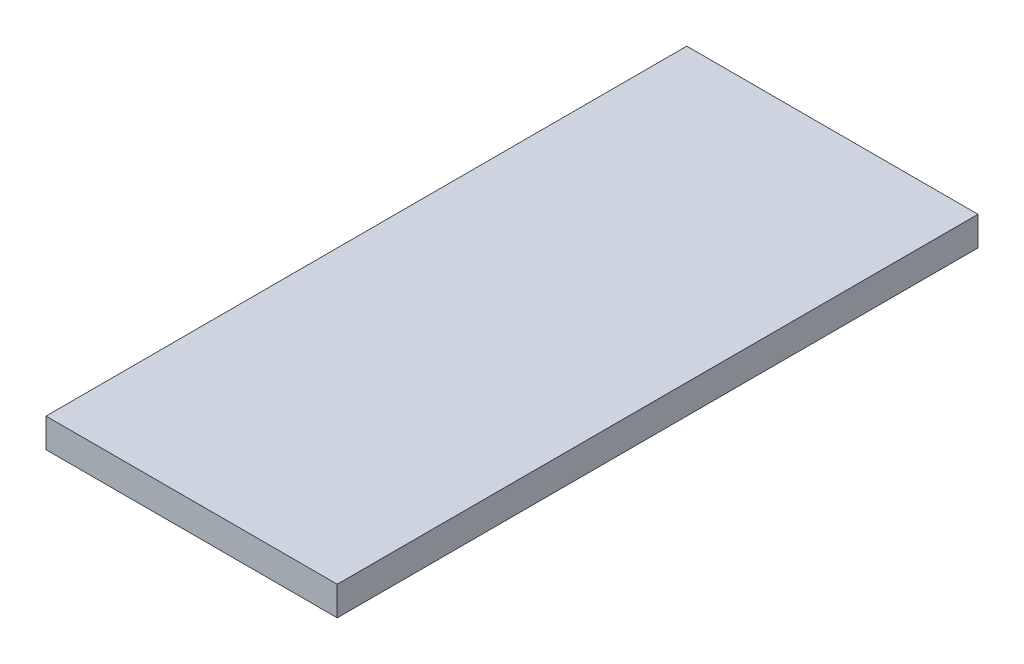
ISO-10303-21;
HEADER;
FILE_DESCRIPTION(('STEP AP214'),'2;1');
FILE_NAME('part.step','',(''),(''),'','','');
FILE_SCHEMA(('AUTOMOTIVE_DESIGN { 1 0 10303 214 1 1 1 1 }'));
ENDSEC;
DATA;
#1=APPLICATION_CONTEXT('core data for automotive mechanical design processes');
#2=APPLICATION_PROTOCOL_DEFINITION('international standard','automotive_design',2000,#1);
#3=PRODUCT_CONTEXT('',#1,'mechanical');
#4=PRODUCT('Part','Part','',(#3));
#5=PRODUCT_RELATED_PRODUCT_CATEGORY('part','',(#4));
#6=PRODUCT_DEFINITION_FORMATION('','',#4);
#7=PRODUCT_DEFINITION_CONTEXT('part definition',#1,'design');
#8=PRODUCT_DEFINITION('design','',#6,#7);
#9=PRODUCT_DEFINITION_SHAPE('','',#8);
#10=(LENGTH_UNIT() NAMED_UNIT(*) SI_UNIT(.MILLI.,.METRE.));
#11=(NAMED_UNIT(*) PLANE_ANGLE_UNIT() SI_UNIT($,.RADIAN.));
#12=(NAMED_UNIT(*) SI_UNIT($,.STERADIAN.) SOLID_ANGLE_UNIT());
#13=UNCERTAINTY_MEASURE_WITH_UNIT(LENGTH_MEASURE(1.E-05),#10,'distance_accuracy_value','');
#14=(GEOMETRIC_REPRESENTATION_CONTEXT(3) GLOBAL_UNCERTAINTY_ASSIGNED_CONTEXT((#13)) GLOBAL_UNIT_ASSIGNED_CONTEXT((#10,
#11,#12)) REPRESENTATION_CONTEXT('',''));
#15=CARTESIAN_POINT('',(0.,0.,0.));
#16=DIRECTION('',(0.,0.,1.));
#17=DIRECTION('',(1.,0.,0.));
#18=AXIS2_PLACEMENT_3D('',#15,#16,#17);
#19=CARTESIAN_POINT('',(-5.0578034682081,5.,-39.342485549133));
#20=DIRECTION('',(-1.,0.,0.));
#21=DIRECTION('',(0.,0.,1.));
#22=AXIS2_PLACEMENT_3D('',#19,#20,#21);
#23=PLANE('',#22);
#24=DIRECTION('',(0.,0.,-1.));
#25=VECTOR('',#24,1.);
#26=CARTESIAN_POINT('',(-5.0578034682081,0.,-39.342485549133));
#27=LINE('',#26,#25);
#28=CARTESIAN_POINT('',(-5.0578034682081,0.,70.657514450867));
#29=VERTEX_POINT('',#28);
#30=CARTESIAN_POINT('',(-5.0578034682081,0.,-39.342485549133));
#31=VERTEX_POINT('',#30);
#32=EDGE_CURVE('E96',#29,#31,#27,.T.);
#33=ORIENTED_EDGE('',*,*,#32,.T.);
#34=DIRECTION('',(0.,-1.,0.));
#35=VECTOR('',#34,1.);
#36=CARTESIAN_POINT('',(-5.0578034682081,5.,-39.342485549133));
#37=LINE('',#36,#35);
#38=CARTESIAN_POINT('',(-5.0578034682081,5.,-39.342485549133));
#39=VERTEX_POINT('',#38);
#40=EDGE_CURVE('E11',#39,#31,#37,.T.);
#41=ORIENTED_EDGE('',*,*,#40,.F.);
#42=DIRECTION('',(0.,0.,-1.));
#43=VECTOR('',#42,1.);
#44=CARTESIAN_POINT('',(-5.0578034682081,5.,-39.342485549133));
#45=LINE('',#44,#43);
#46=CARTESIAN_POINT('',(-5.0578034682081,5.,70.657514450867));
#47=VERTEX_POINT('',#46);
#48=EDGE_CURVE('E84',#47,#39,#45,.T.);
#49=ORIENTED_EDGE('',*,*,#48,.F.);
#50=DIRECTION('',(0.,-1.,0.));
#51=VECTOR('',#50,1.);
#52=CARTESIAN_POINT('',(-5.0578034682081,5.,70.657514450867));
#53=LINE('',#52,#51);
#54=EDGE_CURVE('E92',#47,#29,#53,.T.);
#55=ORIENTED_EDGE('',*,*,#54,.T.);
#56=EDGE_LOOP('',(#33,#41,#49,#55));
#57=FACE_BOUND('',#56,.T.);
#58=ADVANCED_FACE('F33',(#57),#23,.F.);
#59=CARTESIAN_POINT('',(-55.0578034682081,5.,-39.342485549133));
#60=DIRECTION('',(0.,0.,1.));
#61=DIRECTION('',(1.,0.,0.));
#62=AXIS2_PLACEMENT_3D('',#59,#60,#61);
#63=PLANE('',#62);
#64=DIRECTION('',(-1.,0.,0.));
#65=VECTOR('',#64,1.);
#66=CARTESIAN_POINT('',(-55.0578034682081,0.,-39.342485549133));
#67=LINE('',#66,#65);
#68=CARTESIAN_POINT('',(-55.0578034682081,0.,-39.342485549133));
#69=VERTEX_POINT('',#68);
#70=EDGE_CURVE('E88',#31,#69,#67,.T.);
#71=ORIENTED_EDGE('',*,*,#70,.T.);
#72=DIRECTION('',(0.,-1.,0.));
#73=VECTOR('',#72,1.);
#74=CARTESIAN_POINT('',(-55.0578034682081,5.,-39.342485549133));
#75=LINE('',#74,#73);
#76=CARTESIAN_POINT('',(-55.0578034682081,5.,-39.342485549133));
#77=VERTEX_POINT('',#76);
#78=EDGE_CURVE('E41',#77,#69,#75,.T.);
#79=ORIENTED_EDGE('',*,*,#78,.F.);
#80=DIRECTION('',(-1.,0.,0.));
#81=VECTOR('',#80,1.);
#82=CARTESIAN_POINT('',(-55.0578034682081,5.,-39.342485549133));
#83=LINE('',#82,#81);
#84=EDGE_CURVE('E79',#39,#77,#83,.T.);
#85=ORIENTED_EDGE('',*,*,#84,.F.);
#86=ORIENTED_EDGE('',*,*,#40,.T.);
#87=EDGE_LOOP('',(#71,#79,#85,#86));
#88=FACE_BOUND('',#87,.T.);
#89=ADVANCED_FACE('F87',(#88),#63,.F.);
#90=CARTESIAN_POINT('',(-55.0578034682081,5.,-39.342485549133));
#91=DIRECTION('',(1.,0.,0.));
#92=DIRECTION('',(0.,0.,-1.));
#93=AXIS2_PLACEMENT_3D('',#90,#91,#92);
#94=PLANE('',#93);
#95=DIRECTION('',(0.,0.,1.));
#96=VECTOR('',#95,1.);
#97=CARTESIAN_POINT('',(-55.0578034682081,0.,-39.342485549133));
#98=LINE('',#97,#96);
#99=CARTESIAN_POINT('',(-55.0578034682081,0.,70.657514450867));
#100=VERTEX_POINT('',#99);
#101=EDGE_CURVE('E66',#69,#100,#98,.T.);
#102=ORIENTED_EDGE('',*,*,#101,.T.);
#103=DIRECTION('',(0.,-1.,0.));
#104=VECTOR('',#103,1.);
#105=CARTESIAN_POINT('',(-55.0578034682081,5.,70.657514450867));
#106=LINE('',#105,#104);
#107=CARTESIAN_POINT('',(-55.0578034682081,5.,70.657514450867));
#108=VERTEX_POINT('',#107);
#109=EDGE_CURVE('E89',#108,#100,#106,.T.);
#110=ORIENTED_EDGE('',*,*,#109,.F.);
#111=DIRECTION('',(0.,0.,1.));
#112=VECTOR('',#111,1.);
#113=CARTESIAN_POINT('',(-55.0578034682081,5.,-39.342485549133));
#114=LINE('',#113,#112);
#115=EDGE_CURVE('E82',#77,#108,#114,.T.);
#116=ORIENTED_EDGE('',*,*,#115,.F.);
#117=ORIENTED_EDGE('',*,*,#78,.T.);
#118=EDGE_LOOP('',(#102,#110,#116,#117));
#119=FACE_BOUND('',#118,.T.);
#120=ADVANCED_FACE('F90',(#119),#94,.F.);
#121=CARTESIAN_POINT('',(-55.0578034682081,5.,70.657514450867));
#122=DIRECTION('',(0.,0.,-1.));
#123=DIRECTION('',(-1.,0.,0.));
#124=AXIS2_PLACEMENT_3D('',#121,#122,#123);
#125=PLANE('',#124);
#126=DIRECTION('',(1.,0.,0.));
#127=VECTOR('',#126,1.);
#128=CARTESIAN_POINT('',(-55.0578034682081,0.,70.657514450867));
#129=LINE('',#128,#127);
#130=EDGE_CURVE('E72',#100,#29,#129,.T.);
#131=ORIENTED_EDGE('',*,*,#130,.T.);
#132=ORIENTED_EDGE('',*,*,#54,.F.);
#133=DIRECTION('',(1.,0.,0.));
#134=VECTOR('',#133,1.);
#135=CARTESIAN_POINT('',(-55.0578034682081,5.,70.657514450867));
#136=LINE('',#135,#134);
#137=EDGE_CURVE('E49',#108,#47,#136,.T.);
#138=ORIENTED_EDGE('',*,*,#137,.F.);
#139=ORIENTED_EDGE('',*,*,#109,.T.);
#140=EDGE_LOOP('',(#131,#132,#138,#139));
#141=FACE_BOUND('',#140,.T.);
#142=ADVANCED_FACE('F103',(#141),#125,.F.);
#143=CARTESIAN_POINT('',(0.,5.,0.));
#144=DIRECTION('',(0.,1.,0.));
#145=DIRECTION('',(0.,0.,1.));
#146=AXIS2_PLACEMENT_3D('',#143,#144,#145);
#147=PLANE('',#146);
#148=ORIENTED_EDGE('',*,*,#48,.T.);
#149=ORIENTED_EDGE('',*,*,#84,.T.);
#150=ORIENTED_EDGE('',*,*,#115,.T.);
#151=ORIENTED_EDGE('',*,*,#137,.T.);
#152=EDGE_LOOP('',(#148,#149,#150,#151));
#153=FACE_BOUND('',#152,.T.);
#154=ADVANCED_FACE('F80',(#153),#147,.T.);
#155=CARTESIAN_POINT('',(0.,0.,0.));
#156=DIRECTION('',(0.,1.,0.));
#157=DIRECTION('',(0.,0.,1.));
#158=AXIS2_PLACEMENT_3D('',#155,#156,#157);
#159=PLANE('',#158);
#160=ORIENTED_EDGE('',*,*,#32,.F.);
#161=ORIENTED_EDGE('',*,*,#130,.F.);
#162=ORIENTED_EDGE('',*,*,#101,.F.);
#163=ORIENTED_EDGE('',*,*,#70,.F.);
#164=EDGE_LOOP('',(#160,#161,#162,#163));
#165=FACE_BOUND('',#164,.T.);
#166=ADVANCED_FACE('F106',(#165),#159,.F.);
#167=CLOSED_SHELL('',(#58,#89,#120,#142,#154,#166));
#168=MANIFOLD_SOLID_BREP('B2',#167);
#169=ADVANCED_BREP_SHAPE_REPRESENTATION('',(#18,#168),#14);
#170=SHAPE_DEFINITION_REPRESENTATION(#9,#169);
ENDSEC;
END-ISO-10303-21;
